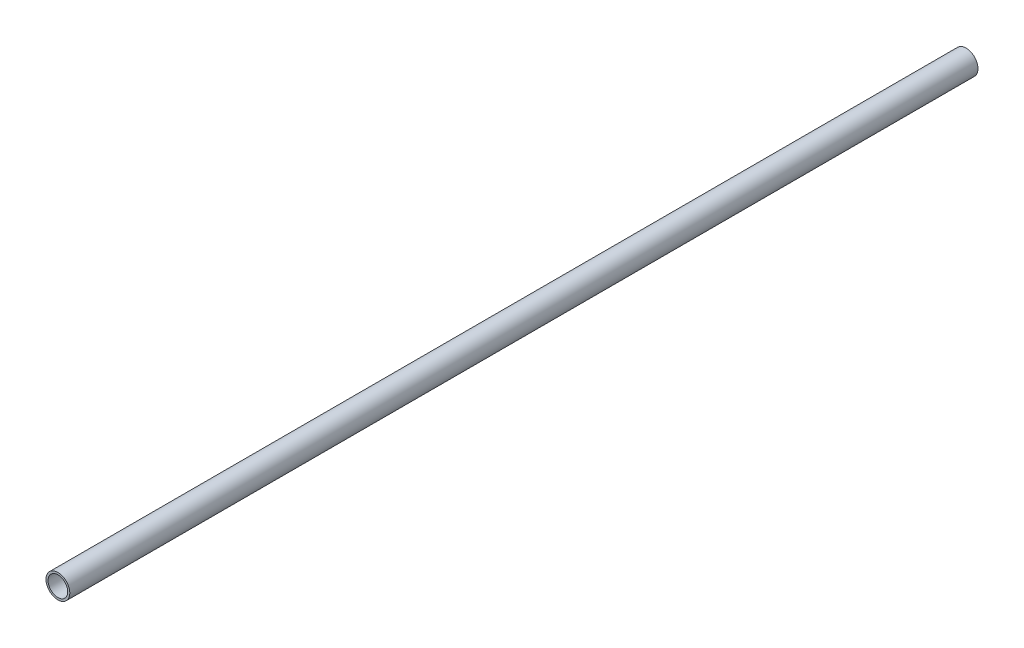
ISO-10303-21;
HEADER;
FILE_DESCRIPTION(('STEP AP214'),'2;1');
FILE_NAME('part.step','',(''),(''),'','','');
FILE_SCHEMA(('AUTOMOTIVE_DESIGN { 1 0 10303 214 1 1 1 1 }'));
ENDSEC;
DATA;
#1=APPLICATION_CONTEXT('core data for automotive mechanical design processes');
#2=APPLICATION_PROTOCOL_DEFINITION('international standard','automotive_design',2000,#1);
#3=PRODUCT_CONTEXT('',#1,'mechanical');
#4=PRODUCT('Part','Part','',(#3));
#5=PRODUCT_RELATED_PRODUCT_CATEGORY('part','',(#4));
#6=PRODUCT_DEFINITION_FORMATION('','',#4);
#7=PRODUCT_DEFINITION_CONTEXT('part definition',#1,'design');
#8=PRODUCT_DEFINITION('design','',#6,#7);
#9=PRODUCT_DEFINITION_SHAPE('','',#8);
#10=(LENGTH_UNIT() NAMED_UNIT(*) SI_UNIT(.MILLI.,.METRE.));
#11=(NAMED_UNIT(*) PLANE_ANGLE_UNIT() SI_UNIT($,.RADIAN.));
#12=(NAMED_UNIT(*) SI_UNIT($,.STERADIAN.) SOLID_ANGLE_UNIT());
#13=UNCERTAINTY_MEASURE_WITH_UNIT(LENGTH_MEASURE(1.E-05),#10,'distance_accuracy_value','');
#14=(GEOMETRIC_REPRESENTATION_CONTEXT(3) GLOBAL_UNCERTAINTY_ASSIGNED_CONTEXT((#13)) GLOBAL_UNIT_ASSIGNED_CONTEXT((#10,
#11,#12)) REPRESENTATION_CONTEXT('',''));
#15=CARTESIAN_POINT('',(0.,0.,0.));
#16=DIRECTION('',(0.,0.,1.));
#17=DIRECTION('',(1.,0.,0.));
#18=AXIS2_PLACEMENT_3D('',#15,#16,#17);
#19=CARTESIAN_POINT('',(0.,0.,457.2));
#20=DIRECTION('',(0.,0.,1.));
#21=DIRECTION('',(1.,0.,0.));
#22=AXIS2_PLACEMENT_3D('',#19,#20,#21);
#23=PLANE('',#22);
#24=CARTESIAN_POINT('',(0.,0.,457.2));
#25=DIRECTION('',(0.,0.,1.));
#26=DIRECTION('',(1.,0.,0.));
#27=AXIS2_PLACEMENT_3D('',#24,#25,#26);
#28=CIRCLE('',#27,5.9944);
#29=CARTESIAN_POINT('',(5.9944,0.,457.2));
#30=VERTEX_POINT('',#29);
#31=EDGE_CURVE('E10',#30,#30,#28,.T.);
#32=ORIENTED_EDGE('',*,*,#31,.T.);
#33=EDGE_LOOP('',(#32));
#34=FACE_BOUND('',#33,.T.);
#35=CARTESIAN_POINT('',(0.,0.,457.2));
#36=DIRECTION('',(0.,0.,1.));
#37=DIRECTION('',(1.,0.,0.));
#38=AXIS2_PLACEMENT_3D('',#35,#36,#37);
#39=CIRCLE('',#38,4.953);
#40=CARTESIAN_POINT('',(4.953,0.,457.2));
#41=VERTEX_POINT('',#40);
#42=EDGE_CURVE('E46',#41,#41,#39,.T.);
#43=ORIENTED_EDGE('',*,*,#42,.F.);
#44=EDGE_LOOP('',(#43));
#45=FACE_BOUND('',#44,.T.);
#46=ADVANCED_FACE('F35',(#34,#45),#23,.T.);
#47=CARTESIAN_POINT('',(0.,0.,0.));
#48=DIRECTION('',(0.,0.,1.));
#49=DIRECTION('',(1.,0.,0.));
#50=AXIS2_PLACEMENT_3D('',#47,#48,#49);
#51=PLANE('',#50);
#52=CARTESIAN_POINT('',(0.,0.,0.));
#53=DIRECTION('',(0.,0.,1.));
#54=DIRECTION('',(1.,0.,0.));
#55=AXIS2_PLACEMENT_3D('',#52,#53,#54);
#56=CIRCLE('',#55,5.9944);
#57=CARTESIAN_POINT('',(5.9944,0.,0.));
#58=VERTEX_POINT('',#57);
#59=EDGE_CURVE('E39',#58,#58,#56,.T.);
#60=ORIENTED_EDGE('',*,*,#59,.F.);
#61=EDGE_LOOP('',(#60));
#62=FACE_BOUND('',#61,.T.);
#63=CARTESIAN_POINT('',(0.,0.,0.));
#64=DIRECTION('',(0.,0.,1.));
#65=DIRECTION('',(1.,0.,0.));
#66=AXIS2_PLACEMENT_3D('',#63,#64,#65);
#67=CIRCLE('',#66,4.953);
#68=CARTESIAN_POINT('',(4.953,0.,0.));
#69=VERTEX_POINT('',#68);
#70=EDGE_CURVE('E48',#69,#69,#67,.T.);
#71=ORIENTED_EDGE('',*,*,#70,.T.);
#72=EDGE_LOOP('',(#71));
#73=FACE_BOUND('',#72,.T.);
#74=ADVANCED_FACE('F58',(#62,#73),#51,.F.);
#75=CARTESIAN_POINT('',(0.,0.,457.2));
#76=DIRECTION('',(0.,0.,-1.));
#77=DIRECTION('',(-1.,0.,0.));
#78=AXIS2_PLACEMENT_3D('',#75,#76,#77);
#79=CYLINDRICAL_SURFACE('',#78,5.9944);
#80=ORIENTED_EDGE('',*,*,#31,.F.);
#81=EDGE_LOOP('',(#80));
#82=FACE_BOUND('',#81,.T.);
#83=ORIENTED_EDGE('',*,*,#59,.T.);
#84=EDGE_LOOP('',(#83));
#85=FACE_BOUND('',#84,.T.);
#86=ADVANCED_FACE('F37',(#82,#85),#79,.T.);
#87=CARTESIAN_POINT('',(0.,0.,457.2));
#88=DIRECTION('',(0.,0.,-1.));
#89=DIRECTION('',(-1.,0.,0.));
#90=AXIS2_PLACEMENT_3D('',#87,#88,#89);
#91=CYLINDRICAL_SURFACE('',#90,4.953);
#92=ORIENTED_EDGE('',*,*,#42,.T.);
#93=EDGE_LOOP('',(#92));
#94=FACE_BOUND('',#93,.T.);
#95=ORIENTED_EDGE('',*,*,#70,.F.);
#96=EDGE_LOOP('',(#95));
#97=FACE_BOUND('',#96,.T.);
#98=ADVANCED_FACE('F54',(#94,#97),#91,.F.);
#99=CLOSED_SHELL('',(#46,#74,#86,#98));
#100=MANIFOLD_SOLID_BREP('B2',#99);
#101=ADVANCED_BREP_SHAPE_REPRESENTATION('',(#18,#100),#14);
#102=SHAPE_DEFINITION_REPRESENTATION(#9,#101);
ENDSEC;
END-ISO-10303-21;
